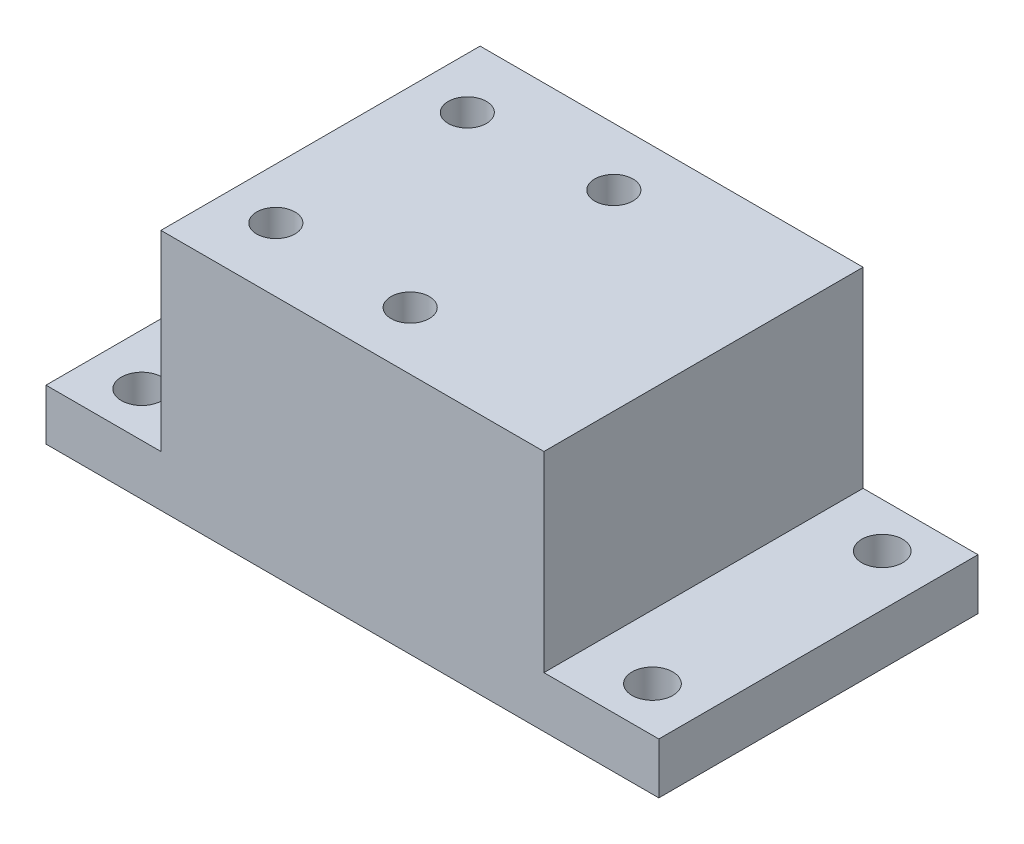
ISO-10303-21;
HEADER;
FILE_DESCRIPTION(('STEP AP214'),'2;1');
FILE_NAME('part.step','',(''),(''),'','','');
FILE_SCHEMA(('AUTOMOTIVE_DESIGN { 1 0 10303 214 1 1 1 1 }'));
ENDSEC;
DATA;
#1=APPLICATION_CONTEXT('core data for automotive mechanical design processes');
#2=APPLICATION_PROTOCOL_DEFINITION('international standard','automotive_design',2000,#1);
#3=PRODUCT_CONTEXT('',#1,'mechanical');
#4=PRODUCT('Part','Part','',(#3));
#5=PRODUCT_RELATED_PRODUCT_CATEGORY('part','',(#4));
#6=PRODUCT_DEFINITION_FORMATION('','',#4);
#7=PRODUCT_DEFINITION_CONTEXT('part definition',#1,'design');
#8=PRODUCT_DEFINITION('design','',#6,#7);
#9=PRODUCT_DEFINITION_SHAPE('','',#8);
#10=(LENGTH_UNIT() NAMED_UNIT(*) SI_UNIT(.MILLI.,.METRE.));
#11=(NAMED_UNIT(*) PLANE_ANGLE_UNIT() SI_UNIT($,.RADIAN.));
#12=(NAMED_UNIT(*) SI_UNIT($,.STERADIAN.) SOLID_ANGLE_UNIT());
#13=UNCERTAINTY_MEASURE_WITH_UNIT(LENGTH_MEASURE(1.E-05),#10,'distance_accuracy_value','');
#14=(GEOMETRIC_REPRESENTATION_CONTEXT(3) GLOBAL_UNCERTAINTY_ASSIGNED_CONTEXT((#13)) GLOBAL_UNIT_ASSIGNED_CONTEXT((#10,
#11,#12)) REPRESENTATION_CONTEXT('',''));
#15=CARTESIAN_POINT('',(0.,0.,0.));
#16=DIRECTION('',(0.,0.,1.));
#17=DIRECTION('',(1.,0.,0.));
#18=AXIS2_PLACEMENT_3D('',#15,#16,#17);
#19=CARTESIAN_POINT('',(0.,4.,0.));
#20=DIRECTION('',(0.,1.,0.));
#21=DIRECTION('',(0.,0.,1.));
#22=AXIS2_PLACEMENT_3D('',#19,#20,#21);
#23=PLANE('',#22);
#24=CARTESIAN_POINT('',(-20.,4.,-9.));
#25=DIRECTION('',(0.,1.,0.));
#26=DIRECTION('',(0.,0.,1.));
#27=AXIS2_PLACEMENT_3D('',#24,#25,#26);
#28=CIRCLE('',#27,1.6);
#29=CARTESIAN_POINT('',(-20.,4.,-7.4));
#30=VERTEX_POINT('',#29);
#31=EDGE_CURVE('E213',#30,#30,#28,.T.);
#32=ORIENTED_EDGE('',*,*,#31,.F.);
#33=EDGE_LOOP('',(#32));
#34=FACE_BOUND('',#33,.T.);
#35=CARTESIAN_POINT('',(-20.,4.,9.));
#36=DIRECTION('',(0.,1.,0.));
#37=DIRECTION('',(0.,0.,1.));
#38=AXIS2_PLACEMENT_3D('',#35,#36,#37);
#39=CIRCLE('',#38,1.6);
#40=CARTESIAN_POINT('',(-20.,4.,10.6));
#41=VERTEX_POINT('',#40);
#42=EDGE_CURVE('E188',#41,#41,#39,.T.);
#43=ORIENTED_EDGE('',*,*,#42,.F.);
#44=EDGE_LOOP('',(#43));
#45=FACE_BOUND('',#44,.T.);
#46=DIRECTION('',(0.,0.,1.));
#47=VECTOR('',#46,1.);
#48=CARTESIAN_POINT('',(-15.,4.,12.5));
#49=LINE('',#48,#47);
#50=CARTESIAN_POINT('',(-15.,4.,-12.5));
#51=VERTEX_POINT('',#50);
#52=CARTESIAN_POINT('',(-15.,4.,12.5));
#53=VERTEX_POINT('',#52);
#54=EDGE_CURVE('E50',#51,#53,#49,.T.);
#55=ORIENTED_EDGE('',*,*,#54,.F.);
#56=DIRECTION('',(-1.,0.,0.));
#57=VECTOR('',#56,1.);
#58=CARTESIAN_POINT('',(24.,4.,-12.5));
#59=LINE('',#58,#57);
#60=CARTESIAN_POINT('',(-24.,4.,-12.5));
#61=VERTEX_POINT('',#60);
#62=EDGE_CURVE('E139',#51,#61,#59,.T.);
#63=ORIENTED_EDGE('',*,*,#62,.T.);
#64=DIRECTION('',(0.,0.,1.));
#65=VECTOR('',#64,1.);
#66=CARTESIAN_POINT('',(-24.,4.,12.5));
#67=LINE('',#66,#65);
#68=CARTESIAN_POINT('',(-24.,4.,12.5));
#69=VERTEX_POINT('',#68);
#70=EDGE_CURVE('E130',#61,#69,#67,.T.);
#71=ORIENTED_EDGE('',*,*,#70,.T.);
#72=DIRECTION('',(1.,0.,0.));
#73=VECTOR('',#72,1.);
#74=CARTESIAN_POINT('',(24.,4.,12.5));
#75=LINE('',#74,#73);
#76=EDGE_CURVE('E135',#69,#53,#75,.T.);
#77=ORIENTED_EDGE('',*,*,#76,.T.);
#78=EDGE_LOOP('',(#55,#63,#71,#77));
#79=FACE_BOUND('',#78,.T.);
#80=ADVANCED_FACE('F35',(#34,#45,#79),#23,.T.);
#81=CARTESIAN_POINT('',(-24.,4.,12.5));
#82=DIRECTION('',(1.,0.,0.));
#83=DIRECTION('',(0.,0.,-1.));
#84=AXIS2_PLACEMENT_3D('',#81,#82,#83);
#85=PLANE('',#84);
#86=DIRECTION('',(0.,0.,1.));
#87=VECTOR('',#86,1.);
#88=CARTESIAN_POINT('',(-24.,0.,12.5));
#89=LINE('',#88,#87);
#90=CARTESIAN_POINT('',(-24.,0.,-12.5));
#91=VERTEX_POINT('',#90);
#92=CARTESIAN_POINT('',(-24.,0.,12.5));
#93=VERTEX_POINT('',#92);
#94=EDGE_CURVE('E121',#91,#93,#89,.T.);
#95=ORIENTED_EDGE('',*,*,#94,.T.);
#96=DIRECTION('',(0.,-1.,0.));
#97=VECTOR('',#96,1.);
#98=CARTESIAN_POINT('',(-24.,4.,12.5));
#99=LINE('',#98,#97);
#100=EDGE_CURVE('E11',#69,#93,#99,.T.);
#101=ORIENTED_EDGE('',*,*,#100,.F.);
#102=ORIENTED_EDGE('',*,*,#70,.F.);
#103=DIRECTION('',(0.,-1.,0.));
#104=VECTOR('',#103,1.);
#105=CARTESIAN_POINT('',(-24.,4.,-12.5));
#106=LINE('',#105,#104);
#107=EDGE_CURVE('E141',#61,#91,#106,.T.);
#108=ORIENTED_EDGE('',*,*,#107,.T.);
#109=EDGE_LOOP('',(#95,#101,#102,#108));
#110=FACE_BOUND('',#109,.T.);
#111=ADVANCED_FACE('F37',(#110),#85,.F.);
#112=CARTESIAN_POINT('',(24.,4.,12.5));
#113=DIRECTION('',(0.,0.,-1.));
#114=DIRECTION('',(-1.,0.,0.));
#115=AXIS2_PLACEMENT_3D('',#112,#113,#114);
#116=PLANE('',#115);
#117=DIRECTION('',(1.,0.,0.));
#118=VECTOR('',#117,1.);
#119=CARTESIAN_POINT('',(24.,0.,12.5));
#120=LINE('',#119,#118);
#121=CARTESIAN_POINT('',(24.,0.,12.5));
#122=VERTEX_POINT('',#121);
#123=EDGE_CURVE('E124',#93,#122,#120,.T.);
#124=ORIENTED_EDGE('',*,*,#123,.T.);
#125=DIRECTION('',(0.,-1.,0.));
#126=VECTOR('',#125,1.);
#127=CARTESIAN_POINT('',(24.,4.,12.5));
#128=LINE('',#127,#126);
#129=CARTESIAN_POINT('',(24.,4.,12.5));
#130=VERTEX_POINT('',#129);
#131=EDGE_CURVE('E43',#130,#122,#128,.T.);
#132=ORIENTED_EDGE('',*,*,#131,.F.);
#133=CARTESIAN_POINT('',(15.,4.,12.5));
#134=VERTEX_POINT('',#133);
#135=EDGE_CURVE('E133',#134,#130,#75,.T.);
#136=ORIENTED_EDGE('',*,*,#135,.F.);
#137=DIRECTION('',(0.,-1.,0.));
#138=VECTOR('',#137,1.);
#139=CARTESIAN_POINT('',(15.,19.,12.5));
#140=LINE('',#139,#138);
#141=CARTESIAN_POINT('',(15.,19.,12.5));
#142=VERTEX_POINT('',#141);
#143=EDGE_CURVE('E106',#142,#134,#140,.T.);
#144=ORIENTED_EDGE('',*,*,#143,.F.);
#145=DIRECTION('',(1.,0.,0.));
#146=VECTOR('',#145,1.);
#147=CARTESIAN_POINT('',(15.,19.,12.5));
#148=LINE('',#147,#146);
#149=CARTESIAN_POINT('',(-15.,19.,12.5));
#150=VERTEX_POINT('',#149);
#151=EDGE_CURVE('E100',#150,#142,#148,.T.);
#152=ORIENTED_EDGE('',*,*,#151,.F.);
#153=DIRECTION('',(0.,-1.,0.));
#154=VECTOR('',#153,1.);
#155=CARTESIAN_POINT('',(-15.,19.,12.5));
#156=LINE('',#155,#154);
#157=EDGE_CURVE('E104',#150,#53,#156,.T.);
#158=ORIENTED_EDGE('',*,*,#157,.T.);
#159=ORIENTED_EDGE('',*,*,#76,.F.);
#160=ORIENTED_EDGE('',*,*,#100,.T.);
#161=EDGE_LOOP('',(#124,#132,#136,#144,#152,#158,#159,#160));
#162=FACE_BOUND('',#161,.T.);
#163=ADVANCED_FACE('F102',(#162),#116,.F.);
#164=CARTESIAN_POINT('',(24.,4.,12.5));
#165=DIRECTION('',(-1.,0.,0.));
#166=DIRECTION('',(0.,0.,1.));
#167=AXIS2_PLACEMENT_3D('',#164,#165,#166);
#168=PLANE('',#167);
#169=DIRECTION('',(0.,0.,-1.));
#170=VECTOR('',#169,1.);
#171=CARTESIAN_POINT('',(24.,0.,12.5));
#172=LINE('',#171,#170);
#173=CARTESIAN_POINT('',(24.,0.,-12.5));
#174=VERTEX_POINT('',#173);
#175=EDGE_CURVE('E144',#122,#174,#172,.T.);
#176=ORIENTED_EDGE('',*,*,#175,.T.);
#177=DIRECTION('',(0.,-1.,0.));
#178=VECTOR('',#177,1.);
#179=CARTESIAN_POINT('',(24.,4.,-12.5));
#180=LINE('',#179,#178);
#181=CARTESIAN_POINT('',(24.,4.,-12.5));
#182=VERTEX_POINT('',#181);
#183=EDGE_CURVE('E149',#182,#174,#180,.T.);
#184=ORIENTED_EDGE('',*,*,#183,.F.);
#185=DIRECTION('',(0.,0.,-1.));
#186=VECTOR('',#185,1.);
#187=CARTESIAN_POINT('',(24.,4.,12.5));
#188=LINE('',#187,#186);
#189=EDGE_CURVE('E137',#130,#182,#188,.T.);
#190=ORIENTED_EDGE('',*,*,#189,.F.);
#191=ORIENTED_EDGE('',*,*,#131,.T.);
#192=EDGE_LOOP('',(#176,#184,#190,#191));
#193=FACE_BOUND('',#192,.T.);
#194=ADVANCED_FACE('F156',(#193),#168,.F.);
#195=CARTESIAN_POINT('',(24.,4.,-12.5));
#196=DIRECTION('',(0.,0.,1.));
#197=DIRECTION('',(1.,0.,0.));
#198=AXIS2_PLACEMENT_3D('',#195,#196,#197);
#199=PLANE('',#198);
#200=DIRECTION('',(-1.,0.,0.));
#201=VECTOR('',#200,1.);
#202=CARTESIAN_POINT('',(24.,0.,-12.5));
#203=LINE('',#202,#201);
#204=EDGE_CURVE('E134',#174,#91,#203,.T.);
#205=ORIENTED_EDGE('',*,*,#204,.T.);
#206=ORIENTED_EDGE('',*,*,#107,.F.);
#207=ORIENTED_EDGE('',*,*,#62,.F.);
#208=DIRECTION('',(0.,-1.,0.));
#209=VECTOR('',#208,1.);
#210=CARTESIAN_POINT('',(-15.,19.,-12.5));
#211=LINE('',#210,#209);
#212=CARTESIAN_POINT('',(-15.,19.,-12.5));
#213=VERTEX_POINT('',#212);
#214=EDGE_CURVE('E169',#213,#51,#211,.T.);
#215=ORIENTED_EDGE('',*,*,#214,.F.);
#216=DIRECTION('',(-1.,0.,0.));
#217=VECTOR('',#216,1.);
#218=CARTESIAN_POINT('',(15.,19.,-12.5));
#219=LINE('',#218,#217);
#220=CARTESIAN_POINT('',(15.,19.,-12.5));
#221=VERTEX_POINT('',#220);
#222=EDGE_CURVE('E115',#221,#213,#219,.T.);
#223=ORIENTED_EDGE('',*,*,#222,.F.);
#224=DIRECTION('',(0.,-1.,0.));
#225=VECTOR('',#224,1.);
#226=CARTESIAN_POINT('',(15.,19.,-12.5));
#227=LINE('',#226,#225);
#228=CARTESIAN_POINT('',(15.,4.,-12.5));
#229=VERTEX_POINT('',#228);
#230=EDGE_CURVE('E126',#221,#229,#227,.T.);
#231=ORIENTED_EDGE('',*,*,#230,.T.);
#232=EDGE_CURVE('E140',#182,#229,#59,.T.);
#233=ORIENTED_EDGE('',*,*,#232,.F.);
#234=ORIENTED_EDGE('',*,*,#183,.T.);
#235=EDGE_LOOP('',(#205,#206,#207,#215,#223,#231,#233,#234));
#236=FACE_BOUND('',#235,.T.);
#237=ADVANCED_FACE('F164',(#236),#199,.F.);
#238=CARTESIAN_POINT('',(20.,4.,9.));
#239=DIRECTION('',(0.,1.,0.));
#240=DIRECTION('',(0.,0.,1.));
#241=AXIS2_PLACEMENT_3D('',#238,#239,#240);
#242=CIRCLE('',#241,1.6);
#243=CARTESIAN_POINT('',(20.,4.,10.6));
#244=VERTEX_POINT('',#243);
#245=EDGE_CURVE('E207',#244,#244,#242,.T.);
#246=ORIENTED_EDGE('',*,*,#245,.F.);
#247=EDGE_LOOP('',(#246));
#248=FACE_BOUND('',#247,.T.);
#249=CARTESIAN_POINT('',(20.,4.,-9.));
#250=DIRECTION('',(0.,1.,0.));
#251=DIRECTION('',(0.,0.,1.));
#252=AXIS2_PLACEMENT_3D('',#249,#250,#251);
#253=CIRCLE('',#252,1.6);
#254=CARTESIAN_POINT('',(20.,4.,-7.4));
#255=VERTEX_POINT('',#254);
#256=EDGE_CURVE('E210',#255,#255,#253,.T.);
#257=ORIENTED_EDGE('',*,*,#256,.F.);
#258=EDGE_LOOP('',(#257));
#259=FACE_BOUND('',#258,.T.);
#260=DIRECTION('',(0.,0.,-1.));
#261=VECTOR('',#260,1.);
#262=CARTESIAN_POINT('',(15.,4.,12.5));
#263=LINE('',#262,#261);
#264=EDGE_CURVE('E58',#134,#229,#263,.T.);
#265=ORIENTED_EDGE('',*,*,#264,.F.);
#266=ORIENTED_EDGE('',*,*,#135,.T.);
#267=ORIENTED_EDGE('',*,*,#189,.T.);
#268=ORIENTED_EDGE('',*,*,#232,.T.);
#269=EDGE_LOOP('',(#265,#266,#267,#268));
#270=FACE_BOUND('',#269,.T.);
#271=ADVANCED_FACE('F230',(#248,#259,#270),#23,.T.);
#272=CARTESIAN_POINT('',(0.,0.,0.));
#273=DIRECTION('',(0.,1.,0.));
#274=DIRECTION('',(0.,0.,1.));
#275=AXIS2_PLACEMENT_3D('',#272,#273,#274);
#276=PLANE('',#275);
#277=CARTESIAN_POINT('',(20.,0.,9.));
#278=DIRECTION('',(0.,-1.,0.));
#279=DIRECTION('',(0.,0.,-1.));
#280=AXIS2_PLACEMENT_3D('',#277,#278,#279);
#281=CIRCLE('',#280,1.6);
#282=CARTESIAN_POINT('',(20.,0.,7.4));
#283=VERTEX_POINT('',#282);
#284=EDGE_CURVE('E216',#283,#283,#281,.T.);
#285=ORIENTED_EDGE('',*,*,#284,.F.);
#286=EDGE_LOOP('',(#285));
#287=FACE_BOUND('',#286,.T.);
#288=CARTESIAN_POINT('',(20.,0.,-9.));
#289=DIRECTION('',(0.,-1.,0.));
#290=DIRECTION('',(0.,0.,-1.));
#291=AXIS2_PLACEMENT_3D('',#288,#289,#290);
#292=CIRCLE('',#291,1.6);
#293=CARTESIAN_POINT('',(20.,0.,-10.6));
#294=VERTEX_POINT('',#293);
#295=EDGE_CURVE('E220',#294,#294,#292,.T.);
#296=ORIENTED_EDGE('',*,*,#295,.F.);
#297=EDGE_LOOP('',(#296));
#298=FACE_BOUND('',#297,.T.);
#299=CARTESIAN_POINT('',(-20.,0.,-9.));
#300=DIRECTION('',(0.,-1.,0.));
#301=DIRECTION('',(0.,0.,-1.));
#302=AXIS2_PLACEMENT_3D('',#299,#300,#301);
#303=CIRCLE('',#302,1.6);
#304=CARTESIAN_POINT('',(-20.,0.,-10.6));
#305=VERTEX_POINT('',#304);
#306=EDGE_CURVE('E217',#305,#305,#303,.T.);
#307=ORIENTED_EDGE('',*,*,#306,.F.);
#308=EDGE_LOOP('',(#307));
#309=FACE_BOUND('',#308,.T.);
#310=CARTESIAN_POINT('',(-20.,0.,9.));
#311=DIRECTION('',(0.,-1.,0.));
#312=DIRECTION('',(0.,0.,-1.));
#313=AXIS2_PLACEMENT_3D('',#310,#311,#312);
#314=CIRCLE('',#313,1.6);
#315=CARTESIAN_POINT('',(-20.,0.,7.4));
#316=VERTEX_POINT('',#315);
#317=EDGE_CURVE('E204',#316,#316,#314,.T.);
#318=ORIENTED_EDGE('',*,*,#317,.F.);
#319=EDGE_LOOP('',(#318));
#320=FACE_BOUND('',#319,.T.);
#321=CARTESIAN_POINT('',(0.,0.,7.975));
#322=DIRECTION('',(0.,1.,0.));
#323=DIRECTION('',(0.,0.,1.));
#324=AXIS2_PLACEMENT_3D('',#321,#322,#323);
#325=CIRCLE('',#324,1.5);
#326=CARTESIAN_POINT('',(0.,0.,9.475));
#327=VERTEX_POINT('',#326);
#328=EDGE_CURVE('E181',#327,#327,#325,.T.);
#329=ORIENTED_EDGE('',*,*,#328,.T.);
#330=EDGE_LOOP('',(#329));
#331=FACE_BOUND('',#330,.T.);
#332=CARTESIAN_POINT('',(-11.,0.,-7.5));
#333=DIRECTION('',(0.,1.,0.));
#334=DIRECTION('',(0.,0.,1.));
#335=AXIS2_PLACEMENT_3D('',#332,#333,#334);
#336=CIRCLE('',#335,1.5);
#337=CARTESIAN_POINT('',(-11.,0.,-6.));
#338=VERTEX_POINT('',#337);
#339=EDGE_CURVE('E194',#338,#338,#336,.T.);
#340=ORIENTED_EDGE('',*,*,#339,.T.);
#341=EDGE_LOOP('',(#340));
#342=FACE_BOUND('',#341,.T.);
#343=CARTESIAN_POINT('',(-11.,0.,7.5));
#344=DIRECTION('',(0.,1.,0.));
#345=DIRECTION('',(0.,0.,1.));
#346=AXIS2_PLACEMENT_3D('',#343,#344,#345);
#347=CIRCLE('',#346,1.5);
#348=CARTESIAN_POINT('',(-11.,0.,9.));
#349=VERTEX_POINT('',#348);
#350=EDGE_CURVE('E187',#349,#349,#347,.T.);
#351=ORIENTED_EDGE('',*,*,#350,.T.);
#352=EDGE_LOOP('',(#351));
#353=FACE_BOUND('',#352,.T.);
#354=CARTESIAN_POINT('',(0.,0.,-7.975));
#355=DIRECTION('',(0.,1.,0.));
#356=DIRECTION('',(0.,0.,1.));
#357=AXIS2_PLACEMENT_3D('',#354,#355,#356);
#358=CIRCLE('',#357,1.5);
#359=CARTESIAN_POINT('',(0.,0.,-6.475));
#360=VERTEX_POINT('',#359);
#361=EDGE_CURVE('E175',#360,#360,#358,.T.);
#362=ORIENTED_EDGE('',*,*,#361,.T.);
#363=EDGE_LOOP('',(#362));
#364=FACE_BOUND('',#363,.T.);
#365=ORIENTED_EDGE('',*,*,#94,.F.);
#366=ORIENTED_EDGE('',*,*,#204,.F.);
#367=ORIENTED_EDGE('',*,*,#175,.F.);
#368=ORIENTED_EDGE('',*,*,#123,.F.);
#369=EDGE_LOOP('',(#365,#366,#367,#368));
#370=FACE_BOUND('',#369,.T.);
#371=ADVANCED_FACE('F161',(#287,#298,#309,#320,#331,#342,#353,#364,#370),#276,.F.);
#372=CARTESIAN_POINT('',(-15.,19.,12.5));
#373=DIRECTION('',(1.,0.,0.));
#374=DIRECTION('',(0.,0.,-1.));
#375=AXIS2_PLACEMENT_3D('',#372,#373,#374);
#376=PLANE('',#375);
#377=ORIENTED_EDGE('',*,*,#54,.T.);
#378=ORIENTED_EDGE('',*,*,#157,.F.);
#379=DIRECTION('',(0.,0.,1.));
#380=VECTOR('',#379,1.);
#381=CARTESIAN_POINT('',(-15.,19.,12.5));
#382=LINE('',#381,#380);
#383=EDGE_CURVE('E110',#213,#150,#382,.T.);
#384=ORIENTED_EDGE('',*,*,#383,.F.);
#385=ORIENTED_EDGE('',*,*,#214,.T.);
#386=EDGE_LOOP('',(#377,#378,#384,#385));
#387=FACE_BOUND('',#386,.T.);
#388=ADVANCED_FACE('F120',(#387),#376,.F.);
#389=CARTESIAN_POINT('',(15.,19.,12.5));
#390=DIRECTION('',(-1.,0.,0.));
#391=DIRECTION('',(0.,0.,1.));
#392=AXIS2_PLACEMENT_3D('',#389,#390,#391);
#393=PLANE('',#392);
#394=ORIENTED_EDGE('',*,*,#264,.T.);
#395=ORIENTED_EDGE('',*,*,#230,.F.);
#396=DIRECTION('',(0.,0.,-1.));
#397=VECTOR('',#396,1.);
#398=CARTESIAN_POINT('',(15.,19.,12.5));
#399=LINE('',#398,#397);
#400=EDGE_CURVE('E109',#142,#221,#399,.T.);
#401=ORIENTED_EDGE('',*,*,#400,.F.);
#402=ORIENTED_EDGE('',*,*,#143,.T.);
#403=EDGE_LOOP('',(#394,#395,#401,#402));
#404=FACE_BOUND('',#403,.T.);
#405=ADVANCED_FACE('F254',(#404),#393,.F.);
#406=CARTESIAN_POINT('',(0.,19.,0.));
#407=DIRECTION('',(0.,1.,0.));
#408=DIRECTION('',(0.,0.,1.));
#409=AXIS2_PLACEMENT_3D('',#406,#407,#408);
#410=PLANE('',#409);
#411=CARTESIAN_POINT('',(0.,19.,7.975));
#412=DIRECTION('',(0.,1.,0.));
#413=DIRECTION('',(0.,0.,1.));
#414=AXIS2_PLACEMENT_3D('',#411,#412,#413);
#415=CIRCLE('',#414,1.5);
#416=CARTESIAN_POINT('',(0.,19.,9.475));
#417=VERTEX_POINT('',#416);
#418=EDGE_CURVE('E197',#417,#417,#415,.T.);
#419=ORIENTED_EDGE('',*,*,#418,.F.);
#420=EDGE_LOOP('',(#419));
#421=FACE_BOUND('',#420,.T.);
#422=CARTESIAN_POINT('',(-11.,19.,-7.5));
#423=DIRECTION('',(0.,1.,0.));
#424=DIRECTION('',(0.,0.,1.));
#425=AXIS2_PLACEMENT_3D('',#422,#423,#424);
#426=CIRCLE('',#425,1.5);
#427=CARTESIAN_POINT('',(-11.,19.,-6.));
#428=VERTEX_POINT('',#427);
#429=EDGE_CURVE('E191',#428,#428,#426,.T.);
#430=ORIENTED_EDGE('',*,*,#429,.F.);
#431=EDGE_LOOP('',(#430));
#432=FACE_BOUND('',#431,.T.);
#433=CARTESIAN_POINT('',(-11.,19.,7.5));
#434=DIRECTION('',(0.,1.,0.));
#435=DIRECTION('',(0.,0.,1.));
#436=AXIS2_PLACEMENT_3D('',#433,#434,#435);
#437=CIRCLE('',#436,1.5);
#438=CARTESIAN_POINT('',(-11.,19.,9.));
#439=VERTEX_POINT('',#438);
#440=EDGE_CURVE('E184',#439,#439,#437,.T.);
#441=ORIENTED_EDGE('',*,*,#440,.F.);
#442=EDGE_LOOP('',(#441));
#443=FACE_BOUND('',#442,.T.);
#444=CARTESIAN_POINT('',(0.,19.,-7.975));
#445=DIRECTION('',(0.,1.,0.));
#446=DIRECTION('',(0.,0.,1.));
#447=AXIS2_PLACEMENT_3D('',#444,#445,#446);
#448=CIRCLE('',#447,1.5);
#449=CARTESIAN_POINT('',(0.,19.,-6.475));
#450=VERTEX_POINT('',#449);
#451=EDGE_CURVE('E178',#450,#450,#448,.T.);
#452=ORIENTED_EDGE('',*,*,#451,.F.);
#453=EDGE_LOOP('',(#452));
#454=FACE_BOUND('',#453,.T.);
#455=ORIENTED_EDGE('',*,*,#383,.T.);
#456=ORIENTED_EDGE('',*,*,#151,.T.);
#457=ORIENTED_EDGE('',*,*,#400,.T.);
#458=ORIENTED_EDGE('',*,*,#222,.T.);
#459=EDGE_LOOP('',(#455,#456,#457,#458));
#460=FACE_BOUND('',#459,.T.);
#461=ADVANCED_FACE('F113',(#421,#432,#443,#454,#460),#410,.T.);
#462=CARTESIAN_POINT('',(0.,0.,-7.975));
#463=DIRECTION('',(0.,1.,0.));
#464=DIRECTION('',(0.,0.,1.));
#465=AXIS2_PLACEMENT_3D('',#462,#463,#464);
#466=CYLINDRICAL_SURFACE('',#465,1.5);
#467=ORIENTED_EDGE('',*,*,#361,.F.);
#468=EDGE_LOOP('',(#467));
#469=FACE_BOUND('',#468,.T.);
#470=ORIENTED_EDGE('',*,*,#451,.T.);
#471=EDGE_LOOP('',(#470));
#472=FACE_BOUND('',#471,.T.);
#473=ADVANCED_FACE('F246',(#469,#472),#466,.F.);
#474=CARTESIAN_POINT('',(-11.,0.,7.5));
#475=DIRECTION('',(0.,1.,0.));
#476=DIRECTION('',(0.,0.,1.));
#477=AXIS2_PLACEMENT_3D('',#474,#475,#476);
#478=CYLINDRICAL_SURFACE('',#477,1.5);
#479=ORIENTED_EDGE('',*,*,#350,.F.);
#480=EDGE_LOOP('',(#479));
#481=FACE_BOUND('',#480,.T.);
#482=ORIENTED_EDGE('',*,*,#440,.T.);
#483=EDGE_LOOP('',(#482));
#484=FACE_BOUND('',#483,.T.);
#485=ADVANCED_FACE('F249',(#481,#484),#478,.F.);
#486=CARTESIAN_POINT('',(-11.,0.,-7.5));
#487=DIRECTION('',(0.,1.,0.));
#488=DIRECTION('',(0.,0.,1.));
#489=AXIS2_PLACEMENT_3D('',#486,#487,#488);
#490=CYLINDRICAL_SURFACE('',#489,1.5);
#491=ORIENTED_EDGE('',*,*,#339,.F.);
#492=EDGE_LOOP('',(#491));
#493=FACE_BOUND('',#492,.T.);
#494=ORIENTED_EDGE('',*,*,#429,.T.);
#495=EDGE_LOOP('',(#494));
#496=FACE_BOUND('',#495,.T.);
#497=ADVANCED_FACE('F304',(#493,#496),#490,.F.);
#498=CARTESIAN_POINT('',(0.,0.,7.975));
#499=DIRECTION('',(0.,1.,0.));
#500=DIRECTION('',(0.,0.,1.));
#501=AXIS2_PLACEMENT_3D('',#498,#499,#500);
#502=CYLINDRICAL_SURFACE('',#501,1.5);
#503=ORIENTED_EDGE('',*,*,#328,.F.);
#504=EDGE_LOOP('',(#503));
#505=FACE_BOUND('',#504,.T.);
#506=ORIENTED_EDGE('',*,*,#418,.T.);
#507=EDGE_LOOP('',(#506));
#508=FACE_BOUND('',#507,.T.);
#509=ADVANCED_FACE('F300',(#505,#508),#502,.F.);
#510=CARTESIAN_POINT('',(-20.,19.,9.));
#511=DIRECTION('',(0.,-1.,0.));
#512=DIRECTION('',(0.,0.,-1.));
#513=AXIS2_PLACEMENT_3D('',#510,#511,#512);
#514=CYLINDRICAL_SURFACE('',#513,1.6);
#515=ORIENTED_EDGE('',*,*,#42,.T.);
#516=EDGE_LOOP('',(#515));
#517=FACE_BOUND('',#516,.T.);
#518=ORIENTED_EDGE('',*,*,#317,.T.);
#519=EDGE_LOOP('',(#518));
#520=FACE_BOUND('',#519,.T.);
#521=ADVANCED_FACE('F294',(#517,#520),#514,.F.);
#522=CARTESIAN_POINT('',(-20.,19.,-9.));
#523=DIRECTION('',(0.,-1.,0.));
#524=DIRECTION('',(0.,0.,-1.));
#525=AXIS2_PLACEMENT_3D('',#522,#523,#524);
#526=CYLINDRICAL_SURFACE('',#525,1.6);
#527=ORIENTED_EDGE('',*,*,#31,.T.);
#528=EDGE_LOOP('',(#527));
#529=FACE_BOUND('',#528,.T.);
#530=ORIENTED_EDGE('',*,*,#306,.T.);
#531=EDGE_LOOP('',(#530));
#532=FACE_BOUND('',#531,.T.);
#533=ADVANCED_FACE('F286',(#529,#532),#526,.F.);
#534=CARTESIAN_POINT('',(20.,19.,-9.));
#535=DIRECTION('',(0.,-1.,0.));
#536=DIRECTION('',(0.,0.,-1.));
#537=AXIS2_PLACEMENT_3D('',#534,#535,#536);
#538=CYLINDRICAL_SURFACE('',#537,1.6);
#539=ORIENTED_EDGE('',*,*,#256,.T.);
#540=EDGE_LOOP('',(#539));
#541=FACE_BOUND('',#540,.T.);
#542=ORIENTED_EDGE('',*,*,#295,.T.);
#543=EDGE_LOOP('',(#542));
#544=FACE_BOUND('',#543,.T.);
#545=ADVANCED_FACE('F283',(#541,#544),#538,.F.);
#546=CARTESIAN_POINT('',(20.,19.,9.));
#547=DIRECTION('',(0.,-1.,0.));
#548=DIRECTION('',(0.,0.,-1.));
#549=AXIS2_PLACEMENT_3D('',#546,#547,#548);
#550=CYLINDRICAL_SURFACE('',#549,1.6);
#551=ORIENTED_EDGE('',*,*,#245,.T.);
#552=EDGE_LOOP('',(#551));
#553=FACE_BOUND('',#552,.T.);
#554=ORIENTED_EDGE('',*,*,#284,.T.);
#555=EDGE_LOOP('',(#554));
#556=FACE_BOUND('',#555,.T.);
#557=ADVANCED_FACE('F226',(#553,#556),#550,.F.);
#558=CLOSED_SHELL('',(#80,#111,#163,#194,#237,#271,#371,#388,#405,#461,#473,#485,#497,#509,#521,
#533,#545,#557));
#559=MANIFOLD_SOLID_BREP('B2',#558);
#560=ADVANCED_BREP_SHAPE_REPRESENTATION('',(#18,#559),#14);
#561=SHAPE_DEFINITION_REPRESENTATION(#9,#560);
ENDSEC;
END-ISO-10303-21;
